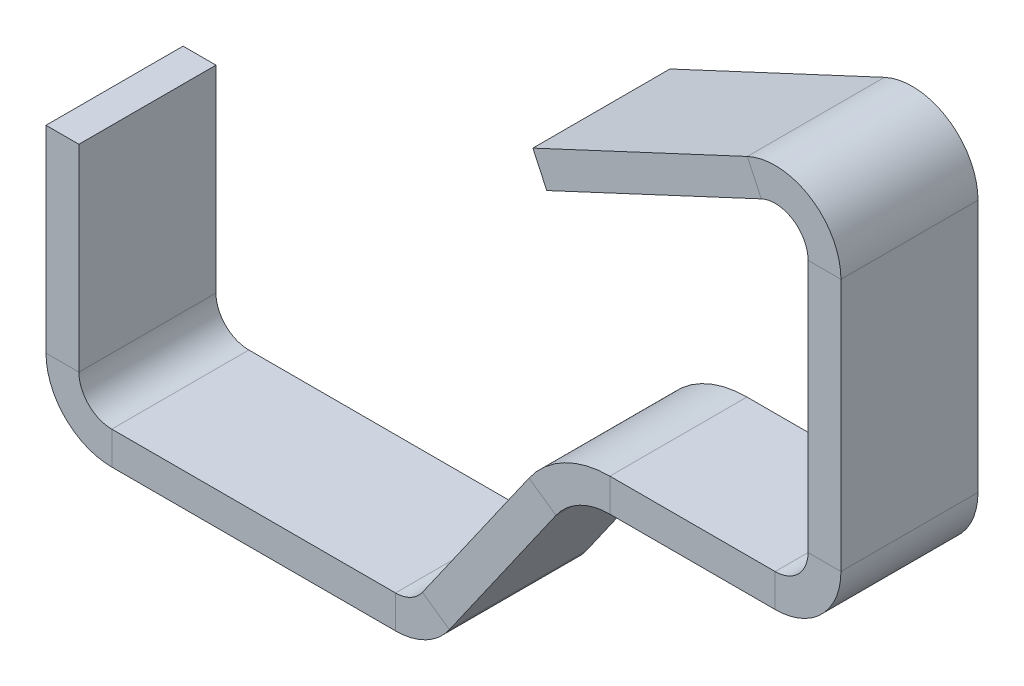
ISO-10303-21;
HEADER;
FILE_DESCRIPTION(('STEP AP214'),'2;1');
FILE_NAME('part.step','',(''),(''),'','','');
FILE_SCHEMA(('AUTOMOTIVE_DESIGN { 1 0 10303 214 1 1 1 1 }'));
ENDSEC;
DATA;
#1=APPLICATION_CONTEXT('core data for automotive mechanical design processes');
#2=APPLICATION_PROTOCOL_DEFINITION('international standard','automotive_design',2000,#1);
#3=PRODUCT_CONTEXT('',#1,'mechanical');
#4=PRODUCT('Part','Part','',(#3));
#5=PRODUCT_RELATED_PRODUCT_CATEGORY('part','',(#4));
#6=PRODUCT_DEFINITION_FORMATION('','',#4);
#7=PRODUCT_DEFINITION_CONTEXT('part definition',#1,'design');
#8=PRODUCT_DEFINITION('design','',#6,#7);
#9=PRODUCT_DEFINITION_SHAPE('','',#8);
#10=(LENGTH_UNIT() NAMED_UNIT(*) SI_UNIT(.MILLI.,.METRE.));
#11=(NAMED_UNIT(*) PLANE_ANGLE_UNIT() SI_UNIT($,.RADIAN.));
#12=(NAMED_UNIT(*) SI_UNIT($,.STERADIAN.) SOLID_ANGLE_UNIT());
#13=UNCERTAINTY_MEASURE_WITH_UNIT(LENGTH_MEASURE(1.E-05),#10,'distance_accuracy_value','');
#14=(GEOMETRIC_REPRESENTATION_CONTEXT(3) GLOBAL_UNCERTAINTY_ASSIGNED_CONTEXT((#13)) GLOBAL_UNIT_ASSIGNED_CONTEXT((#10,
#11,#12)) REPRESENTATION_CONTEXT('',''));
#15=CARTESIAN_POINT('',(0.,0.,0.));
#16=DIRECTION('',(0.,0.,1.));
#17=DIRECTION('',(1.,0.,0.));
#18=AXIS2_PLACEMENT_3D('',#15,#16,#17);
#19=CARTESIAN_POINT('',(0.,0.,0.));
#20=DIRECTION('',(0.,-1.,0.));
#21=DIRECTION('',(1.,0.,0.));
#22=AXIS2_PLACEMENT_3D('',#19,#20,#21);
#23=PLANE('',#22);
#24=DIRECTION('',(0.,0.,-1.));
#25=VECTOR('',#24,1.);
#26=CARTESIAN_POINT('',(0.,0.,-12.5));
#27=LINE('',#26,#25);
#28=CARTESIAN_POINT('',(0.,0.,12.5));
#29=VERTEX_POINT('',#28);
#30=CARTESIAN_POINT('',(0.,0.,-12.5));
#31=VERTEX_POINT('',#30);
#32=EDGE_CURVE('E245',#29,#31,#27,.T.);
#33=ORIENTED_EDGE('',*,*,#32,.F.);
#34=DIRECTION('',(-1.,0.,0.));
#35=VECTOR('',#34,1.);
#36=CARTESIAN_POINT('',(6.,0.,12.5));
#37=LINE('',#36,#35);
#38=CARTESIAN_POINT('',(6.,0.,12.5));
#39=VERTEX_POINT('',#38);
#40=EDGE_CURVE('E229',#39,#29,#37,.T.);
#41=ORIENTED_EDGE('',*,*,#40,.F.);
#42=DIRECTION('',(0.,0.,1.));
#43=VECTOR('',#42,1.);
#44=CARTESIAN_POINT('',(6.,0.,-12.5));
#45=LINE('',#44,#43);
#46=CARTESIAN_POINT('',(6.,0.,-12.5));
#47=VERTEX_POINT('',#46);
#48=EDGE_CURVE('E224',#47,#39,#45,.T.);
#49=ORIENTED_EDGE('',*,*,#48,.F.);
#50=DIRECTION('',(1.,0.,0.));
#51=VECTOR('',#50,1.);
#52=CARTESIAN_POINT('',(6.,0.,-12.5));
#53=LINE('',#52,#51);
#54=EDGE_CURVE('E226',#31,#47,#53,.T.);
#55=ORIENTED_EDGE('',*,*,#54,.F.);
#56=EDGE_LOOP('',(#33,#41,#49,#55));
#57=FACE_BOUND('',#56,.T.);
#58=ADVANCED_FACE('F43',(#57),#23,.F.);
#59=CARTESIAN_POINT('',(88.8089172037278,40.7976677720763,0.));
#60=DIRECTION('',(-0.906307787036648,-0.422618261740704,0.));
#61=DIRECTION('',(0.422618261740704,-0.906307787036648,0.));
#62=AXIS2_PLACEMENT_3D('',#59,#60,#61);
#63=PLANE('',#62);
#64=DIRECTION('',(0.,0.,-1.));
#65=VECTOR('',#64,1.);
#66=CARTESIAN_POINT('',(88.8089172037278,40.7976677720763,-12.5));
#67=LINE('',#66,#65);
#68=CARTESIAN_POINT('',(88.8089172037278,40.7976677720763,12.5));
#69=VERTEX_POINT('',#68);
#70=CARTESIAN_POINT('',(88.8089172037278,40.7976677720763,-12.5));
#71=VERTEX_POINT('',#70);
#72=EDGE_CURVE('E57',#69,#71,#67,.T.);
#73=ORIENTED_EDGE('',*,*,#72,.T.);
#74=DIRECTION('',(0.422618261740704,-0.906307787036648,0.));
#75=VECTOR('',#74,1.);
#76=CARTESIAN_POINT('',(91.344626774172,35.3598210498565,-12.5));
#77=LINE('',#76,#75);
#78=CARTESIAN_POINT('',(91.344626774172,35.3598210498565,-12.5));
#79=VERTEX_POINT('',#78);
#80=EDGE_CURVE('E11',#71,#79,#77,.T.);
#81=ORIENTED_EDGE('',*,*,#80,.T.);
#82=DIRECTION('',(0.,0.,1.));
#83=VECTOR('',#82,1.);
#84=CARTESIAN_POINT('',(91.344626774172,35.3598210498565,-12.5));
#85=LINE('',#84,#83);
#86=CARTESIAN_POINT('',(91.344626774172,35.3598210498565,12.5));
#87=VERTEX_POINT('',#86);
#88=EDGE_CURVE('E382',#79,#87,#85,.T.);
#89=ORIENTED_EDGE('',*,*,#88,.T.);
#90=DIRECTION('',(-0.422618261740704,0.906307787036648,0.));
#91=VECTOR('',#90,1.);
#92=CARTESIAN_POINT('',(91.344626774172,35.3598210498565,12.5));
#93=LINE('',#92,#91);
#94=EDGE_CURVE('E63',#87,#69,#93,.T.);
#95=ORIENTED_EDGE('',*,*,#94,.T.);
#96=EDGE_LOOP('',(#73,#81,#89,#95));
#97=FACE_BOUND('',#96,.T.);
#98=ADVANCED_FACE('F664',(#97),#63,.T.);
#99=CARTESIAN_POINT('',(6.,0.,-12.5));
#100=DIRECTION('',(1.,0.,0.));
#101=DIRECTION('',(0.,1.,0.));
#102=AXIS2_PLACEMENT_3D('',#99,#100,#101);
#103=PLANE('',#102);
#104=DIRECTION('',(0.,-1.,0.));
#105=VECTOR('',#104,1.);
#106=CARTESIAN_POINT('',(6.,0.,12.5));
#107=LINE('',#106,#105);
#108=CARTESIAN_POINT('',(6.00000000000001,-35.9999999999999,12.5));
#109=VERTEX_POINT('',#108);
#110=EDGE_CURVE('E254',#39,#109,#107,.T.);
#111=ORIENTED_EDGE('',*,*,#110,.T.);
#112=DIRECTION('',(0.,0.,1.));
#113=VECTOR('',#112,1.);
#114=CARTESIAN_POINT('',(6.00000000000001,-35.9999999999999,-12.5));
#115=LINE('',#114,#113);
#116=CARTESIAN_POINT('',(6.00000000000001,-35.9999999999999,-12.5));
#117=VERTEX_POINT('',#116);
#118=EDGE_CURVE('E250',#117,#109,#115,.T.);
#119=ORIENTED_EDGE('',*,*,#118,.F.);
#120=DIRECTION('',(0.,-1.,0.));
#121=VECTOR('',#120,1.);
#122=CARTESIAN_POINT('',(6.,0.,-12.5));
#123=LINE('',#122,#121);
#124=EDGE_CURVE('E241',#47,#117,#123,.T.);
#125=ORIENTED_EDGE('',*,*,#124,.F.);
#126=ORIENTED_EDGE('',*,*,#48,.T.);
#127=EDGE_LOOP('',(#111,#119,#125,#126));
#128=FACE_BOUND('',#127,.T.);
#129=ADVANCED_FACE('F248',(#128),#103,.T.);
#130=CARTESIAN_POINT('',(6.,0.,12.5));
#131=DIRECTION('',(0.,0.,1.));
#132=DIRECTION('',(1.,0.,0.));
#133=AXIS2_PLACEMENT_3D('',#130,#131,#132);
#134=PLANE('',#133);
#135=DIRECTION('',(0.,-1.,0.));
#136=VECTOR('',#135,1.);
#137=CARTESIAN_POINT('',(0.,0.,12.5));
#138=LINE('',#137,#136);
#139=CARTESIAN_POINT('',(0.,-35.9999999999999,12.5));
#140=VERTEX_POINT('',#139);
#141=EDGE_CURVE('E398',#29,#140,#138,.T.);
#142=ORIENTED_EDGE('',*,*,#141,.T.);
#143=DIRECTION('',(-1.,0.,0.));
#144=VECTOR('',#143,1.);
#145=CARTESIAN_POINT('',(6.00000000000001,-35.9999999999999,12.5));
#146=LINE('',#145,#144);
#147=EDGE_CURVE('E394',#109,#140,#146,.T.);
#148=ORIENTED_EDGE('',*,*,#147,.F.);
#149=ORIENTED_EDGE('',*,*,#110,.F.);
#150=ORIENTED_EDGE('',*,*,#40,.T.);
#151=EDGE_LOOP('',(#142,#148,#149,#150));
#152=FACE_BOUND('',#151,.T.);
#153=ADVANCED_FACE('F710',(#152),#134,.T.);
#154=CARTESIAN_POINT('',(0.,0.,-12.5));
#155=DIRECTION('',(-1.,0.,0.));
#156=DIRECTION('',(0.,-1.,0.));
#157=AXIS2_PLACEMENT_3D('',#154,#155,#156);
#158=PLANE('',#157);
#159=DIRECTION('',(0.,-1.,0.));
#160=VECTOR('',#159,1.);
#161=CARTESIAN_POINT('',(0.,0.,-12.5));
#162=LINE('',#161,#160);
#163=CARTESIAN_POINT('',(0.,-35.9999999999999,-12.5));
#164=VERTEX_POINT('',#163);
#165=EDGE_CURVE('E243',#31,#164,#162,.T.);
#166=ORIENTED_EDGE('',*,*,#165,.T.);
#167=DIRECTION('',(0.,0.,-1.));
#168=VECTOR('',#167,1.);
#169=CARTESIAN_POINT('',(0.,-35.9999999999999,-12.5));
#170=LINE('',#169,#168);
#171=EDGE_CURVE('E402',#140,#164,#170,.T.);
#172=ORIENTED_EDGE('',*,*,#171,.F.);
#173=ORIENTED_EDGE('',*,*,#141,.F.);
#174=ORIENTED_EDGE('',*,*,#32,.T.);
#175=EDGE_LOOP('',(#166,#172,#173,#174));
#176=FACE_BOUND('',#175,.T.);
#177=ADVANCED_FACE('F631',(#176),#158,.T.);
#178=CARTESIAN_POINT('',(6.,0.,-12.5));
#179=DIRECTION('',(0.,0.,-1.));
#180=DIRECTION('',(-1.,0.,0.));
#181=AXIS2_PLACEMENT_3D('',#178,#179,#180);
#182=PLANE('',#181);
#183=DIRECTION('',(1.,0.,0.));
#184=VECTOR('',#183,1.);
#185=CARTESIAN_POINT('',(6.00000000000001,-35.9999999999999,-12.5));
#186=LINE('',#185,#184);
#187=EDGE_CURVE('E271',#164,#117,#186,.T.);
#188=ORIENTED_EDGE('',*,*,#187,.F.);
#189=ORIENTED_EDGE('',*,*,#165,.F.);
#190=ORIENTED_EDGE('',*,*,#54,.T.);
#191=ORIENTED_EDGE('',*,*,#124,.T.);
#192=EDGE_LOOP('',(#188,#189,#190,#191));
#193=FACE_BOUND('',#192,.T.);
#194=ADVANCED_FACE('F240',(#193),#182,.T.);
#195=CARTESIAN_POINT('',(12.,-36.,0.));
#196=DIRECTION('',(0.,0.,1.));
#197=DIRECTION('',(1.,0.,0.));
#198=AXIS2_PLACEMENT_3D('',#195,#196,#197);
#199=CYLINDRICAL_SURFACE('',#198,6.00000000000001);
#200=CARTESIAN_POINT('',(12.,-36.,12.5));
#201=DIRECTION('',(0.,0.,1.));
#202=DIRECTION('',(-1.,0.,0.));
#203=AXIS2_PLACEMENT_3D('',#200,#201,#202);
#204=CIRCLE('',#203,6.00000000000001);
#205=CARTESIAN_POINT('',(12.0000000000001,-42.,12.5));
#206=VERTEX_POINT('',#205);
#207=EDGE_CURVE('E262',#109,#206,#204,.T.);
#208=ORIENTED_EDGE('',*,*,#207,.T.);
#209=DIRECTION('',(0.,0.,1.));
#210=VECTOR('',#209,1.);
#211=CARTESIAN_POINT('',(12.0000000000001,-42.,-12.5));
#212=LINE('',#211,#210);
#213=CARTESIAN_POINT('',(12.0000000000001,-42.,-12.5));
#214=VERTEX_POINT('',#213);
#215=EDGE_CURVE('E258',#214,#206,#212,.T.);
#216=ORIENTED_EDGE('',*,*,#215,.F.);
#217=CARTESIAN_POINT('',(12.,-36.,-12.5));
#218=DIRECTION('',(0.,0.,1.));
#219=DIRECTION('',(-1.,0.,0.));
#220=AXIS2_PLACEMENT_3D('',#217,#218,#219);
#221=CIRCLE('',#220,6.00000000000001);
#222=EDGE_CURVE('E263',#117,#214,#221,.T.);
#223=ORIENTED_EDGE('',*,*,#222,.F.);
#224=ORIENTED_EDGE('',*,*,#118,.T.);
#225=EDGE_LOOP('',(#208,#216,#223,#224));
#226=FACE_BOUND('',#225,.T.);
#227=ADVANCED_FACE('F627',(#226),#199,.F.);
#228=CARTESIAN_POINT('',(6.00000000000001,-35.9999999999999,12.5));
#229=DIRECTION('',(0.,0.,1.));
#230=DIRECTION('',(1.,0.,0.));
#231=AXIS2_PLACEMENT_3D('',#228,#229,#230);
#232=PLANE('',#231);
#233=CARTESIAN_POINT('',(12.,-36.,12.5));
#234=DIRECTION('',(0.,0.,1.));
#235=DIRECTION('',(-1.,0.,0.));
#236=AXIS2_PLACEMENT_3D('',#233,#234,#235);
#237=CIRCLE('',#236,12.);
#238=CARTESIAN_POINT('',(12.0000000000001,-48.,12.5));
#239=VERTEX_POINT('',#238);
#240=EDGE_CURVE('E406',#140,#239,#237,.T.);
#241=ORIENTED_EDGE('',*,*,#240,.T.);
#242=DIRECTION('',(0.,-1.,0.));
#243=VECTOR('',#242,1.);
#244=CARTESIAN_POINT('',(12.0000000000001,-42.,12.5));
#245=LINE('',#244,#243);
#246=EDGE_CURVE('E267',#206,#239,#245,.T.);
#247=ORIENTED_EDGE('',*,*,#246,.F.);
#248=ORIENTED_EDGE('',*,*,#207,.F.);
#249=ORIENTED_EDGE('',*,*,#147,.T.);
#250=EDGE_LOOP('',(#241,#247,#248,#249));
#251=FACE_BOUND('',#250,.T.);
#252=ADVANCED_FACE('F638',(#251),#232,.T.);
#253=CARTESIAN_POINT('',(12.,-36.,0.));
#254=DIRECTION('',(0.,0.,1.));
#255=DIRECTION('',(1.,0.,0.));
#256=AXIS2_PLACEMENT_3D('',#253,#254,#255);
#257=CYLINDRICAL_SURFACE('',#256,12.);
#258=CARTESIAN_POINT('',(12.,-36.,-12.5));
#259=DIRECTION('',(0.,0.,1.));
#260=DIRECTION('',(-1.,0.,0.));
#261=AXIS2_PLACEMENT_3D('',#258,#259,#260);
#262=CIRCLE('',#261,12.);
#263=CARTESIAN_POINT('',(12.0000000000001,-48.,-12.5));
#264=VERTEX_POINT('',#263);
#265=EDGE_CURVE('E485',#164,#264,#262,.T.);
#266=ORIENTED_EDGE('',*,*,#265,.T.);
#267=DIRECTION('',(0.,0.,-1.));
#268=VECTOR('',#267,1.);
#269=CARTESIAN_POINT('',(12.0000000000001,-48.,-12.5));
#270=LINE('',#269,#268);
#271=EDGE_CURVE('E410',#239,#264,#270,.T.);
#272=ORIENTED_EDGE('',*,*,#271,.F.);
#273=ORIENTED_EDGE('',*,*,#240,.F.);
#274=ORIENTED_EDGE('',*,*,#171,.T.);
#275=EDGE_LOOP('',(#266,#272,#273,#274));
#276=FACE_BOUND('',#275,.T.);
#277=ADVANCED_FACE('F634',(#276),#257,.T.);
#278=CARTESIAN_POINT('',(6.00000000000001,-35.9999999999999,-12.5));
#279=DIRECTION('',(0.,0.,-1.));
#280=DIRECTION('',(-1.,0.,0.));
#281=AXIS2_PLACEMENT_3D('',#278,#279,#280);
#282=PLANE('',#281);
#283=DIRECTION('',(0.,1.,0.));
#284=VECTOR('',#283,1.);
#285=CARTESIAN_POINT('',(12.0000000000001,-42.,-12.5));
#286=LINE('',#285,#284);
#287=EDGE_CURVE('E285',#264,#214,#286,.T.);
#288=ORIENTED_EDGE('',*,*,#287,.F.);
#289=ORIENTED_EDGE('',*,*,#265,.F.);
#290=ORIENTED_EDGE('',*,*,#187,.T.);
#291=ORIENTED_EDGE('',*,*,#222,.T.);
#292=EDGE_LOOP('',(#288,#289,#290,#291));
#293=FACE_BOUND('',#292,.T.);
#294=ADVANCED_FACE('F628',(#293),#282,.T.);
#295=CARTESIAN_POINT('',(12.0000000000001,-42.,-12.5));
#296=DIRECTION('',(0.,1.,0.));
#297=DIRECTION('',(-1.,0.,0.));
#298=AXIS2_PLACEMENT_3D('',#295,#296,#297);
#299=PLANE('',#298);
#300=DIRECTION('',(1.,0.,0.));
#301=VECTOR('',#300,1.);
#302=CARTESIAN_POINT('',(12.0000000000001,-42.,12.5));
#303=LINE('',#302,#301);
#304=CARTESIAN_POINT('',(63.753195393379,-42.,12.5));
#305=VERTEX_POINT('',#304);
#306=EDGE_CURVE('E276',#206,#305,#303,.T.);
#307=ORIENTED_EDGE('',*,*,#306,.T.);
#308=DIRECTION('',(0.,0.,1.));
#309=VECTOR('',#308,1.);
#310=CARTESIAN_POINT('',(63.753195393379,-42.,-12.5));
#311=LINE('',#310,#309);
#312=CARTESIAN_POINT('',(63.753195393379,-42.,-12.5));
#313=VERTEX_POINT('',#312);
#314=EDGE_CURVE('E272',#313,#305,#311,.T.);
#315=ORIENTED_EDGE('',*,*,#314,.F.);
#316=DIRECTION('',(1.,0.,0.));
#317=VECTOR('',#316,1.);
#318=CARTESIAN_POINT('',(12.0000000000001,-42.,-12.5));
#319=LINE('',#318,#317);
#320=EDGE_CURVE('E277',#214,#313,#319,.T.);
#321=ORIENTED_EDGE('',*,*,#320,.F.);
#322=ORIENTED_EDGE('',*,*,#215,.T.);
#323=EDGE_LOOP('',(#307,#315,#321,#322));
#324=FACE_BOUND('',#323,.T.);
#325=ADVANCED_FACE('F621',(#324),#299,.T.);
#326=CARTESIAN_POINT('',(12.0000000000001,-42.,12.5));
#327=DIRECTION('',(0.,0.,1.));
#328=DIRECTION('',(1.,0.,0.));
#329=AXIS2_PLACEMENT_3D('',#326,#327,#328);
#330=PLANE('',#329);
#331=DIRECTION('',(1.,0.,0.));
#332=VECTOR('',#331,1.);
#333=CARTESIAN_POINT('',(12.0000000000001,-48.,12.5));
#334=LINE('',#333,#332);
#335=CARTESIAN_POINT('',(63.753195393379,-48.,12.5));
#336=VERTEX_POINT('',#335);
#337=EDGE_CURVE('E414',#239,#336,#334,.T.);
#338=ORIENTED_EDGE('',*,*,#337,.T.);
#339=DIRECTION('',(0.,-1.,0.));
#340=VECTOR('',#339,1.);
#341=CARTESIAN_POINT('',(63.753195393379,-42.,12.5));
#342=LINE('',#341,#340);
#343=EDGE_CURVE('E281',#305,#336,#342,.T.);
#344=ORIENTED_EDGE('',*,*,#343,.F.);
#345=ORIENTED_EDGE('',*,*,#306,.F.);
#346=ORIENTED_EDGE('',*,*,#246,.T.);
#347=EDGE_LOOP('',(#338,#344,#345,#346));
#348=FACE_BOUND('',#347,.T.);
#349=ADVANCED_FACE('F641',(#348),#330,.T.);
#350=CARTESIAN_POINT('',(12.0000000000001,-48.,-12.5));
#351=DIRECTION('',(0.,-1.,0.));
#352=DIRECTION('',(1.,0.,0.));
#353=AXIS2_PLACEMENT_3D('',#350,#351,#352);
#354=PLANE('',#353);
#355=DIRECTION('',(1.,0.,0.));
#356=VECTOR('',#355,1.);
#357=CARTESIAN_POINT('',(12.0000000000001,-48.,-12.5));
#358=LINE('',#357,#356);
#359=CARTESIAN_POINT('',(63.753195393379,-48.,-12.5));
#360=VERTEX_POINT('',#359);
#361=EDGE_CURVE('E492',#264,#360,#358,.T.);
#362=ORIENTED_EDGE('',*,*,#361,.T.);
#363=DIRECTION('',(0.,0.,-1.));
#364=VECTOR('',#363,1.);
#365=CARTESIAN_POINT('',(63.753195393379,-48.,-12.5));
#366=LINE('',#365,#364);
#367=EDGE_CURVE('E418',#336,#360,#366,.T.);
#368=ORIENTED_EDGE('',*,*,#367,.F.);
#369=ORIENTED_EDGE('',*,*,#337,.F.);
#370=ORIENTED_EDGE('',*,*,#271,.T.);
#371=EDGE_LOOP('',(#362,#368,#369,#370));
#372=FACE_BOUND('',#371,.T.);
#373=ADVANCED_FACE('F686',(#372),#354,.T.);
#374=CARTESIAN_POINT('',(12.0000000000001,-42.,-12.5));
#375=DIRECTION('',(0.,0.,-1.));
#376=DIRECTION('',(-1.,0.,0.));
#377=AXIS2_PLACEMENT_3D('',#374,#375,#376);
#378=PLANE('',#377);
#379=DIRECTION('',(0.,1.,0.));
#380=VECTOR('',#379,1.);
#381=CARTESIAN_POINT('',(63.753195393379,-42.,-12.5));
#382=LINE('',#381,#380);
#383=EDGE_CURVE('E299',#360,#313,#382,.T.);
#384=ORIENTED_EDGE('',*,*,#383,.F.);
#385=ORIENTED_EDGE('',*,*,#361,.F.);
#386=ORIENTED_EDGE('',*,*,#287,.T.);
#387=ORIENTED_EDGE('',*,*,#320,.T.);
#388=EDGE_LOOP('',(#384,#385,#386,#387));
#389=FACE_BOUND('',#388,.T.);
#390=ADVANCED_FACE('F622',(#389),#378,.T.);
#391=CARTESIAN_POINT('',(63.7531953933791,-36.,0.));
#392=DIRECTION('',(0.,0.,1.));
#393=DIRECTION('',(1.,0.,0.));
#394=AXIS2_PLACEMENT_3D('',#391,#392,#393);
#395=CYLINDRICAL_SURFACE('',#394,6.);
#396=CARTESIAN_POINT('',(63.7531953933791,-36.,12.5));
#397=DIRECTION('',(0.,0.,1.));
#398=DIRECTION('',(0.,-1.,0.));
#399=AXIS2_PLACEMENT_3D('',#396,#397,#398);
#400=CIRCLE('',#399,6.);
#401=CARTESIAN_POINT('',(68.668107659113,-39.4414586181062,12.5));
#402=VERTEX_POINT('',#401);
#403=EDGE_CURVE('E290',#305,#402,#400,.T.);
#404=ORIENTED_EDGE('',*,*,#403,.T.);
#405=DIRECTION('',(0.,0.,1.));
#406=VECTOR('',#405,1.);
#407=CARTESIAN_POINT('',(68.668107659113,-39.4414586181062,-12.5));
#408=LINE('',#407,#406);
#409=CARTESIAN_POINT('',(68.668107659113,-39.4414586181062,-12.5));
#410=VERTEX_POINT('',#409);
#411=EDGE_CURVE('E286',#410,#402,#408,.T.);
#412=ORIENTED_EDGE('',*,*,#411,.F.);
#413=CARTESIAN_POINT('',(63.7531953933791,-36.,-12.5));
#414=DIRECTION('',(0.,0.,1.));
#415=DIRECTION('',(0.,-1.,0.));
#416=AXIS2_PLACEMENT_3D('',#413,#414,#415);
#417=CIRCLE('',#416,6.);
#418=EDGE_CURVE('E291',#313,#410,#417,.T.);
#419=ORIENTED_EDGE('',*,*,#418,.F.);
#420=ORIENTED_EDGE('',*,*,#314,.T.);
#421=EDGE_LOOP('',(#404,#412,#419,#420));
#422=FACE_BOUND('',#421,.T.);
#423=ADVANCED_FACE('F615',(#422),#395,.F.);
#424=CARTESIAN_POINT('',(63.753195393379,-42.,12.5));
#425=DIRECTION('',(0.,0.,1.));
#426=DIRECTION('',(1.,0.,0.));
#427=AXIS2_PLACEMENT_3D('',#424,#425,#426);
#428=PLANE('',#427);
#429=CARTESIAN_POINT('',(63.7531953933791,-36.,12.5));
#430=DIRECTION('',(0.,0.,1.));
#431=DIRECTION('',(0.,-1.,0.));
#432=AXIS2_PLACEMENT_3D('',#429,#430,#431);
#433=CIRCLE('',#432,12.);
#434=CARTESIAN_POINT('',(73.583019924847,-42.8829172362125,12.5));
#435=VERTEX_POINT('',#434);
#436=EDGE_CURVE('E422',#336,#435,#433,.T.);
#437=ORIENTED_EDGE('',*,*,#436,.T.);
#438=DIRECTION('',(0.819152044288996,-0.573576436351041,0.));
#439=VECTOR('',#438,1.);
#440=CARTESIAN_POINT('',(68.668107659113,-39.4414586181062,12.5));
#441=LINE('',#440,#439);
#442=EDGE_CURVE('E295',#402,#435,#441,.T.);
#443=ORIENTED_EDGE('',*,*,#442,.F.);
#444=ORIENTED_EDGE('',*,*,#403,.F.);
#445=ORIENTED_EDGE('',*,*,#343,.T.);
#446=EDGE_LOOP('',(#437,#443,#444,#445));
#447=FACE_BOUND('',#446,.T.);
#448=ADVANCED_FACE('F644',(#447),#428,.T.);
#449=CARTESIAN_POINT('',(63.7531953933791,-36.,0.));
#450=DIRECTION('',(0.,0.,1.));
#451=DIRECTION('',(1.,0.,0.));
#452=AXIS2_PLACEMENT_3D('',#449,#450,#451);
#453=CYLINDRICAL_SURFACE('',#452,12.);
#454=CARTESIAN_POINT('',(63.7531953933791,-36.,-12.5));
#455=DIRECTION('',(0.,0.,1.));
#456=DIRECTION('',(0.,-1.,0.));
#457=AXIS2_PLACEMENT_3D('',#454,#455,#456);
#458=CIRCLE('',#457,12.);
#459=CARTESIAN_POINT('',(73.583019924847,-42.8829172362125,-12.5));
#460=VERTEX_POINT('',#459);
#461=EDGE_CURVE('E499',#360,#460,#458,.T.);
#462=ORIENTED_EDGE('',*,*,#461,.T.);
#463=DIRECTION('',(0.,0.,-1.));
#464=VECTOR('',#463,1.);
#465=CARTESIAN_POINT('',(73.583019924847,-42.8829172362125,-12.5));
#466=LINE('',#465,#464);
#467=EDGE_CURVE('E426',#435,#460,#466,.T.);
#468=ORIENTED_EDGE('',*,*,#467,.F.);
#469=ORIENTED_EDGE('',*,*,#436,.F.);
#470=ORIENTED_EDGE('',*,*,#367,.T.);
#471=EDGE_LOOP('',(#462,#468,#469,#470));
#472=FACE_BOUND('',#471,.T.);
#473=ADVANCED_FACE('F683',(#472),#453,.T.);
#474=CARTESIAN_POINT('',(63.753195393379,-42.,-12.5));
#475=DIRECTION('',(0.,0.,-1.));
#476=DIRECTION('',(-1.,0.,0.));
#477=AXIS2_PLACEMENT_3D('',#474,#475,#476);
#478=PLANE('',#477);
#479=DIRECTION('',(-0.819152044288996,0.573576436351041,0.));
#480=VECTOR('',#479,1.);
#481=CARTESIAN_POINT('',(68.668107659113,-39.4414586181062,-12.5));
#482=LINE('',#481,#480);
#483=EDGE_CURVE('E313',#460,#410,#482,.T.);
#484=ORIENTED_EDGE('',*,*,#483,.F.);
#485=ORIENTED_EDGE('',*,*,#461,.F.);
#486=ORIENTED_EDGE('',*,*,#383,.T.);
#487=ORIENTED_EDGE('',*,*,#418,.T.);
#488=EDGE_LOOP('',(#484,#485,#486,#487));
#489=FACE_BOUND('',#488,.T.);
#490=ADVANCED_FACE('F616',(#489),#478,.T.);
#491=CARTESIAN_POINT('',(68.668107659113,-39.4414586181062,-12.5));
#492=DIRECTION('',(-0.819152044288993,0.573576436351044,0.));
#493=DIRECTION('',(-0.573576436351044,-0.819152044288994,0.));
#494=AXIS2_PLACEMENT_3D('',#491,#492,#493);
#495=PLANE('',#494);
#496=DIRECTION('',(0.573576436351044,0.819152044288993,0.));
#497=VECTOR('',#496,1.);
#498=CARTESIAN_POINT('',(68.668107659113,-39.4414586181062,12.5));
#499=LINE('',#498,#497);
#500=CARTESIAN_POINT('',(88.1099542613879,-11.6756241456813,12.5));
#501=VERTEX_POINT('',#500);
#502=EDGE_CURVE('E304',#402,#501,#499,.T.);
#503=ORIENTED_EDGE('',*,*,#502,.T.);
#504=DIRECTION('',(0.,0.,1.));
#505=VECTOR('',#504,1.);
#506=CARTESIAN_POINT('',(88.1099542613879,-11.6756241456813,-12.5));
#507=LINE('',#506,#505);
#508=CARTESIAN_POINT('',(88.1099542613879,-11.6756241456813,-12.5));
#509=VERTEX_POINT('',#508);
#510=EDGE_CURVE('E300',#509,#501,#507,.T.);
#511=ORIENTED_EDGE('',*,*,#510,.F.);
#512=DIRECTION('',(0.573576436351044,0.819152044288993,0.));
#513=VECTOR('',#512,1.);
#514=CARTESIAN_POINT('',(68.668107659113,-39.4414586181062,-12.5));
#515=LINE('',#514,#513);
#516=EDGE_CURVE('E305',#410,#509,#515,.T.);
#517=ORIENTED_EDGE('',*,*,#516,.F.);
#518=ORIENTED_EDGE('',*,*,#411,.T.);
#519=EDGE_LOOP('',(#503,#511,#517,#518));
#520=FACE_BOUND('',#519,.T.);
#521=ADVANCED_FACE('F609',(#520),#495,.T.);
#522=CARTESIAN_POINT('',(68.668107659113,-39.4414586181062,12.5));
#523=DIRECTION('',(0.,0.,1.));
#524=DIRECTION('',(1.,0.,0.));
#525=AXIS2_PLACEMENT_3D('',#522,#523,#524);
#526=PLANE('',#525);
#527=DIRECTION('',(0.573576436351044,0.819152044288993,0.));
#528=VECTOR('',#527,1.);
#529=CARTESIAN_POINT('',(73.583019924847,-42.8829172362125,12.5));
#530=LINE('',#529,#528);
#531=CARTESIAN_POINT('',(93.0248665271219,-15.1170827637875,12.5));
#532=VERTEX_POINT('',#531);
#533=EDGE_CURVE('E430',#435,#532,#530,.T.);
#534=ORIENTED_EDGE('',*,*,#533,.T.);
#535=DIRECTION('',(0.819152044288993,-0.573576436351044,0.));
#536=VECTOR('',#535,1.);
#537=CARTESIAN_POINT('',(88.1099542613879,-11.6756241456813,12.5));
#538=LINE('',#537,#536);
#539=EDGE_CURVE('E309',#501,#532,#538,.T.);
#540=ORIENTED_EDGE('',*,*,#539,.F.);
#541=ORIENTED_EDGE('',*,*,#502,.F.);
#542=ORIENTED_EDGE('',*,*,#442,.T.);
#543=EDGE_LOOP('',(#534,#540,#541,#542));
#544=FACE_BOUND('',#543,.T.);
#545=ADVANCED_FACE('F647',(#544),#526,.T.);
#546=CARTESIAN_POINT('',(73.583019924847,-42.8829172362125,-12.5));
#547=DIRECTION('',(0.819152044288993,-0.573576436351044,0.));
#548=DIRECTION('',(0.573576436351044,0.819152044288994,0.));
#549=AXIS2_PLACEMENT_3D('',#546,#547,#548);
#550=PLANE('',#549);
#551=DIRECTION('',(0.573576436351044,0.819152044288993,0.));
#552=VECTOR('',#551,1.);
#553=CARTESIAN_POINT('',(73.583019924847,-42.8829172362125,-12.5));
#554=LINE('',#553,#552);
#555=CARTESIAN_POINT('',(93.0248665271219,-15.1170827637875,-12.5));
#556=VERTEX_POINT('',#555);
#557=EDGE_CURVE('E506',#460,#556,#554,.T.);
#558=ORIENTED_EDGE('',*,*,#557,.T.);
#559=DIRECTION('',(0.,0.,-1.));
#560=VECTOR('',#559,1.);
#561=CARTESIAN_POINT('',(93.0248665271219,-15.1170827637875,-12.5));
#562=LINE('',#561,#560);
#563=EDGE_CURVE('E434',#532,#556,#562,.T.);
#564=ORIENTED_EDGE('',*,*,#563,.F.);
#565=ORIENTED_EDGE('',*,*,#533,.F.);
#566=ORIENTED_EDGE('',*,*,#467,.T.);
#567=EDGE_LOOP('',(#558,#564,#565,#566));
#568=FACE_BOUND('',#567,.T.);
#569=ADVANCED_FACE('F680',(#568),#550,.T.);
#570=CARTESIAN_POINT('',(68.668107659113,-39.4414586181062,-12.5));
#571=DIRECTION('',(0.,0.,-1.));
#572=DIRECTION('',(-1.,0.,0.));
#573=AXIS2_PLACEMENT_3D('',#570,#571,#572);
#574=PLANE('',#573);
#575=DIRECTION('',(-0.819152044288993,0.573576436351044,0.));
#576=VECTOR('',#575,1.);
#577=CARTESIAN_POINT('',(88.1099542613879,-11.6756241456813,-12.5));
#578=LINE('',#577,#576);
#579=EDGE_CURVE('E327',#556,#509,#578,.T.);
#580=ORIENTED_EDGE('',*,*,#579,.F.);
#581=ORIENTED_EDGE('',*,*,#557,.F.);
#582=ORIENTED_EDGE('',*,*,#483,.T.);
#583=ORIENTED_EDGE('',*,*,#516,.T.);
#584=EDGE_LOOP('',(#580,#581,#582,#583));
#585=FACE_BOUND('',#584,.T.);
#586=ADVANCED_FACE('F610',(#585),#574,.T.);
#587=CARTESIAN_POINT('',(102.85469105859,-22.,0.));
#588=DIRECTION('',(0.,0.,-1.));
#589=DIRECTION('',(-1.,0.,0.));
#590=AXIS2_PLACEMENT_3D('',#587,#588,#589);
#591=CYLINDRICAL_SURFACE('',#590,18.);
#592=CARTESIAN_POINT('',(102.85469105859,-22.,12.5));
#593=DIRECTION('',(0.,0.,-1.));
#594=DIRECTION('',(-0.819152044288996,0.573576436351041,0.));
#595=AXIS2_PLACEMENT_3D('',#592,#593,#594);
#596=CIRCLE('',#595,18.);
#597=CARTESIAN_POINT('',(102.85469105859,-4.00000000000002,12.5));
#598=VERTEX_POINT('',#597);
#599=EDGE_CURVE('E318',#501,#598,#596,.T.);
#600=ORIENTED_EDGE('',*,*,#599,.T.);
#601=DIRECTION('',(0.,0.,1.));
#602=VECTOR('',#601,1.);
#603=CARTESIAN_POINT('',(102.85469105859,-4.00000000000001,-12.5));
#604=LINE('',#603,#602);
#605=CARTESIAN_POINT('',(102.85469105859,-4.00000000000002,-12.5));
#606=VERTEX_POINT('',#605);
#607=EDGE_CURVE('E314',#606,#598,#604,.T.);
#608=ORIENTED_EDGE('',*,*,#607,.F.);
#609=CARTESIAN_POINT('',(102.85469105859,-22.,-12.5));
#610=DIRECTION('',(0.,0.,-1.));
#611=DIRECTION('',(-0.819152044288996,0.573576436351041,0.));
#612=AXIS2_PLACEMENT_3D('',#609,#610,#611);
#613=CIRCLE('',#612,18.);
#614=EDGE_CURVE('E319',#509,#606,#613,.T.);
#615=ORIENTED_EDGE('',*,*,#614,.F.);
#616=ORIENTED_EDGE('',*,*,#510,.T.);
#617=EDGE_LOOP('',(#600,#608,#615,#616));
#618=FACE_BOUND('',#617,.T.);
#619=ADVANCED_FACE('F603',(#618),#591,.T.);
#620=CARTESIAN_POINT('',(88.1099542613879,-11.6756241456813,12.5));
#621=DIRECTION('',(0.,0.,1.));
#622=DIRECTION('',(1.,0.,0.));
#623=AXIS2_PLACEMENT_3D('',#620,#621,#622);
#624=PLANE('',#623);
#625=CARTESIAN_POINT('',(102.85469105859,-22.,12.5));
#626=DIRECTION('',(0.,0.,-1.));
#627=DIRECTION('',(-0.819152044288996,0.573576436351041,0.));
#628=AXIS2_PLACEMENT_3D('',#625,#626,#627);
#629=CIRCLE('',#628,12.);
#630=CARTESIAN_POINT('',(102.85469105859,-10.,12.5));
#631=VERTEX_POINT('',#630);
#632=EDGE_CURVE('E438',#532,#631,#629,.T.);
#633=ORIENTED_EDGE('',*,*,#632,.T.);
#634=DIRECTION('',(0.,-1.,0.));
#635=VECTOR('',#634,1.);
#636=CARTESIAN_POINT('',(102.85469105859,-4.00000000000001,12.5));
#637=LINE('',#636,#635);
#638=EDGE_CURVE('E323',#598,#631,#637,.T.);
#639=ORIENTED_EDGE('',*,*,#638,.F.);
#640=ORIENTED_EDGE('',*,*,#599,.F.);
#641=ORIENTED_EDGE('',*,*,#539,.T.);
#642=EDGE_LOOP('',(#633,#639,#640,#641));
#643=FACE_BOUND('',#642,.T.);
#644=ADVANCED_FACE('F650',(#643),#624,.T.);
#645=CARTESIAN_POINT('',(102.85469105859,-22.,0.));
#646=DIRECTION('',(0.,0.,-1.));
#647=DIRECTION('',(-1.,0.,0.));
#648=AXIS2_PLACEMENT_3D('',#645,#646,#647);
#649=CYLINDRICAL_SURFACE('',#648,12.);
#650=CARTESIAN_POINT('',(102.85469105859,-22.,-12.5));
#651=DIRECTION('',(0.,0.,-1.));
#652=DIRECTION('',(-0.819152044288996,0.573576436351041,0.));
#653=AXIS2_PLACEMENT_3D('',#650,#651,#652);
#654=CIRCLE('',#653,12.);
#655=CARTESIAN_POINT('',(102.85469105859,-10.,-12.5));
#656=VERTEX_POINT('',#655);
#657=EDGE_CURVE('E513',#556,#656,#654,.T.);
#658=ORIENTED_EDGE('',*,*,#657,.T.);
#659=DIRECTION('',(0.,0.,-1.));
#660=VECTOR('',#659,1.);
#661=CARTESIAN_POINT('',(102.85469105859,-10.,-12.5));
#662=LINE('',#661,#660);
#663=EDGE_CURVE('E442',#631,#656,#662,.T.);
#664=ORIENTED_EDGE('',*,*,#663,.F.);
#665=ORIENTED_EDGE('',*,*,#632,.F.);
#666=ORIENTED_EDGE('',*,*,#563,.T.);
#667=EDGE_LOOP('',(#658,#664,#665,#666));
#668=FACE_BOUND('',#667,.T.);
#669=ADVANCED_FACE('F677',(#668),#649,.F.);
#670=CARTESIAN_POINT('',(88.1099542613879,-11.6756241456813,-12.5));
#671=DIRECTION('',(0.,0.,-1.));
#672=DIRECTION('',(-1.,0.,0.));
#673=AXIS2_PLACEMENT_3D('',#670,#671,#672);
#674=PLANE('',#673);
#675=DIRECTION('',(0.,1.,0.));
#676=VECTOR('',#675,1.);
#677=CARTESIAN_POINT('',(102.85469105859,-4.00000000000001,-12.5));
#678=LINE('',#677,#676);
#679=EDGE_CURVE('E341',#656,#606,#678,.T.);
#680=ORIENTED_EDGE('',*,*,#679,.F.);
#681=ORIENTED_EDGE('',*,*,#657,.F.);
#682=ORIENTED_EDGE('',*,*,#579,.T.);
#683=ORIENTED_EDGE('',*,*,#614,.T.);
#684=EDGE_LOOP('',(#680,#681,#682,#683));
#685=FACE_BOUND('',#684,.T.);
#686=ADVANCED_FACE('F604',(#685),#674,.T.);
#687=CARTESIAN_POINT('',(102.85469105859,-4.00000000000001,-12.5));
#688=DIRECTION('',(0.,1.,0.));
#689=DIRECTION('',(-1.,0.,0.));
#690=AXIS2_PLACEMENT_3D('',#687,#688,#689);
#691=PLANE('',#690);
#692=DIRECTION('',(1.,0.,0.));
#693=VECTOR('',#692,1.);
#694=CARTESIAN_POINT('',(102.85469105859,-4.00000000000001,12.5));
#695=LINE('',#694,#693);
#696=CARTESIAN_POINT('',(133.,-4.00000000000001,12.5));
#697=VERTEX_POINT('',#696);
#698=EDGE_CURVE('E332',#598,#697,#695,.T.);
#699=ORIENTED_EDGE('',*,*,#698,.T.);
#700=DIRECTION('',(0.,0.,1.));
#701=VECTOR('',#700,1.);
#702=CARTESIAN_POINT('',(133.,-4.00000000000001,-12.5));
#703=LINE('',#702,#701);
#704=CARTESIAN_POINT('',(133.,-4.00000000000001,-12.5));
#705=VERTEX_POINT('',#704);
#706=EDGE_CURVE('E328',#705,#697,#703,.T.);
#707=ORIENTED_EDGE('',*,*,#706,.F.);
#708=DIRECTION('',(1.,0.,0.));
#709=VECTOR('',#708,1.);
#710=CARTESIAN_POINT('',(102.85469105859,-4.00000000000001,-12.5));
#711=LINE('',#710,#709);
#712=EDGE_CURVE('E333',#606,#705,#711,.T.);
#713=ORIENTED_EDGE('',*,*,#712,.F.);
#714=ORIENTED_EDGE('',*,*,#607,.T.);
#715=EDGE_LOOP('',(#699,#707,#713,#714));
#716=FACE_BOUND('',#715,.T.);
#717=ADVANCED_FACE('F597',(#716),#691,.T.);
#718=CARTESIAN_POINT('',(102.85469105859,-4.00000000000001,12.5));
#719=DIRECTION('',(0.,0.,1.));
#720=DIRECTION('',(1.,0.,0.));
#721=AXIS2_PLACEMENT_3D('',#718,#719,#720);
#722=PLANE('',#721);
#723=DIRECTION('',(1.,0.,0.));
#724=VECTOR('',#723,1.);
#725=CARTESIAN_POINT('',(102.85469105859,-10.,12.5));
#726=LINE('',#725,#724);
#727=CARTESIAN_POINT('',(133.,-10.,12.5));
#728=VERTEX_POINT('',#727);
#729=EDGE_CURVE('E446',#631,#728,#726,.T.);
#730=ORIENTED_EDGE('',*,*,#729,.T.);
#731=DIRECTION('',(0.,-1.,0.));
#732=VECTOR('',#731,1.);
#733=CARTESIAN_POINT('',(133.,-4.00000000000001,12.5));
#734=LINE('',#733,#732);
#735=EDGE_CURVE('E337',#697,#728,#734,.T.);
#736=ORIENTED_EDGE('',*,*,#735,.F.);
#737=ORIENTED_EDGE('',*,*,#698,.F.);
#738=ORIENTED_EDGE('',*,*,#638,.T.);
#739=EDGE_LOOP('',(#730,#736,#737,#738));
#740=FACE_BOUND('',#739,.T.);
#741=ADVANCED_FACE('F653',(#740),#722,.T.);
#742=CARTESIAN_POINT('',(102.85469105859,-10.,-12.5));
#743=DIRECTION('',(0.,-1.,0.));
#744=DIRECTION('',(1.,0.,0.));
#745=AXIS2_PLACEMENT_3D('',#742,#743,#744);
#746=PLANE('',#745);
#747=DIRECTION('',(1.,0.,0.));
#748=VECTOR('',#747,1.);
#749=CARTESIAN_POINT('',(102.85469105859,-10.,-12.5));
#750=LINE('',#749,#748);
#751=CARTESIAN_POINT('',(133.,-10.,-12.5));
#752=VERTEX_POINT('',#751);
#753=EDGE_CURVE('E520',#656,#752,#750,.T.);
#754=ORIENTED_EDGE('',*,*,#753,.T.);
#755=DIRECTION('',(0.,0.,-1.));
#756=VECTOR('',#755,1.);
#757=CARTESIAN_POINT('',(133.,-10.,-12.5));
#758=LINE('',#757,#756);
#759=EDGE_CURVE('E450',#728,#752,#758,.T.);
#760=ORIENTED_EDGE('',*,*,#759,.F.);
#761=ORIENTED_EDGE('',*,*,#729,.F.);
#762=ORIENTED_EDGE('',*,*,#663,.T.);
#763=EDGE_LOOP('',(#754,#760,#761,#762));
#764=FACE_BOUND('',#763,.T.);
#765=ADVANCED_FACE('F674',(#764),#746,.T.);
#766=CARTESIAN_POINT('',(102.85469105859,-4.00000000000001,-12.5));
#767=DIRECTION('',(0.,0.,-1.));
#768=DIRECTION('',(-1.,0.,0.));
#769=AXIS2_PLACEMENT_3D('',#766,#767,#768);
#770=PLANE('',#769);
#771=DIRECTION('',(0.,1.,0.));
#772=VECTOR('',#771,1.);
#773=CARTESIAN_POINT('',(133.,-4.00000000000001,-12.5));
#774=LINE('',#773,#772);
#775=EDGE_CURVE('E355',#752,#705,#774,.T.);
#776=ORIENTED_EDGE('',*,*,#775,.F.);
#777=ORIENTED_EDGE('',*,*,#753,.F.);
#778=ORIENTED_EDGE('',*,*,#679,.T.);
#779=ORIENTED_EDGE('',*,*,#712,.T.);
#780=EDGE_LOOP('',(#776,#777,#778,#779));
#781=FACE_BOUND('',#780,.T.);
#782=ADVANCED_FACE('F598',(#781),#770,.T.);
#783=CARTESIAN_POINT('',(133.,1.99999999999999,0.));
#784=DIRECTION('',(0.,0.,1.));
#785=DIRECTION('',(1.,0.,0.));
#786=AXIS2_PLACEMENT_3D('',#783,#784,#785);
#787=CYLINDRICAL_SURFACE('',#786,6.00000000000001);
#788=CARTESIAN_POINT('',(133.,1.99999999999999,12.5));
#789=DIRECTION('',(0.,0.,1.));
#790=DIRECTION('',(0.,-1.,0.));
#791=AXIS2_PLACEMENT_3D('',#788,#789,#790);
#792=CIRCLE('',#791,6.00000000000001);
#793=CARTESIAN_POINT('',(139.,1.99999999999999,12.5));
#794=VERTEX_POINT('',#793);
#795=EDGE_CURVE('E346',#697,#794,#792,.T.);
#796=ORIENTED_EDGE('',*,*,#795,.T.);
#797=DIRECTION('',(0.,0.,1.));
#798=VECTOR('',#797,1.);
#799=CARTESIAN_POINT('',(139.,1.99999999999999,-12.5));
#800=LINE('',#799,#798);
#801=CARTESIAN_POINT('',(139.,1.99999999999999,-12.5));
#802=VERTEX_POINT('',#801);
#803=EDGE_CURVE('E342',#802,#794,#800,.T.);
#804=ORIENTED_EDGE('',*,*,#803,.F.);
#805=CARTESIAN_POINT('',(133.,1.99999999999999,-12.5));
#806=DIRECTION('',(0.,0.,1.));
#807=DIRECTION('',(0.,-1.,0.));
#808=AXIS2_PLACEMENT_3D('',#805,#806,#807);
#809=CIRCLE('',#808,6.00000000000001);
#810=EDGE_CURVE('E347',#705,#802,#809,.T.);
#811=ORIENTED_EDGE('',*,*,#810,.F.);
#812=ORIENTED_EDGE('',*,*,#706,.T.);
#813=EDGE_LOOP('',(#796,#804,#811,#812));
#814=FACE_BOUND('',#813,.T.);
#815=ADVANCED_FACE('F591',(#814),#787,.F.);
#816=CARTESIAN_POINT('',(133.,-4.00000000000002,12.5));
#817=DIRECTION('',(0.,0.,1.));
#818=DIRECTION('',(1.,0.,0.));
#819=AXIS2_PLACEMENT_3D('',#816,#817,#818);
#820=PLANE('',#819);
#821=CARTESIAN_POINT('',(133.,1.99999999999999,12.5));
#822=DIRECTION('',(0.,0.,1.));
#823=DIRECTION('',(0.,-1.,0.));
#824=AXIS2_PLACEMENT_3D('',#821,#822,#823);
#825=CIRCLE('',#824,12.);
#826=CARTESIAN_POINT('',(145.,1.99999999999999,12.5));
#827=VERTEX_POINT('',#826);
#828=EDGE_CURVE('E454',#728,#827,#825,.T.);
#829=ORIENTED_EDGE('',*,*,#828,.T.);
#830=DIRECTION('',(1.,0.,0.));
#831=VECTOR('',#830,1.);
#832=CARTESIAN_POINT('',(139.,1.99999999999999,12.5));
#833=LINE('',#832,#831);
#834=EDGE_CURVE('E351',#794,#827,#833,.T.);
#835=ORIENTED_EDGE('',*,*,#834,.F.);
#836=ORIENTED_EDGE('',*,*,#795,.F.);
#837=ORIENTED_EDGE('',*,*,#735,.T.);
#838=EDGE_LOOP('',(#829,#835,#836,#837));
#839=FACE_BOUND('',#838,.T.);
#840=ADVANCED_FACE('F656',(#839),#820,.T.);
#841=CARTESIAN_POINT('',(133.,1.99999999999999,0.));
#842=DIRECTION('',(0.,0.,1.));
#843=DIRECTION('',(1.,0.,0.));
#844=AXIS2_PLACEMENT_3D('',#841,#842,#843);
#845=CYLINDRICAL_SURFACE('',#844,12.);
#846=CARTESIAN_POINT('',(133.,1.99999999999999,-12.5));
#847=DIRECTION('',(0.,0.,1.));
#848=DIRECTION('',(0.,-1.,0.));
#849=AXIS2_PLACEMENT_3D('',#846,#847,#848);
#850=CIRCLE('',#849,12.);
#851=CARTESIAN_POINT('',(145.,1.99999999999999,-12.5));
#852=VERTEX_POINT('',#851);
#853=EDGE_CURVE('E527',#752,#852,#850,.T.);
#854=ORIENTED_EDGE('',*,*,#853,.T.);
#855=DIRECTION('',(0.,0.,-1.));
#856=VECTOR('',#855,1.);
#857=CARTESIAN_POINT('',(145.,1.99999999999999,-12.5));
#858=LINE('',#857,#856);
#859=EDGE_CURVE('E458',#827,#852,#858,.T.);
#860=ORIENTED_EDGE('',*,*,#859,.F.);
#861=ORIENTED_EDGE('',*,*,#828,.F.);
#862=ORIENTED_EDGE('',*,*,#759,.T.);
#863=EDGE_LOOP('',(#854,#860,#861,#862));
#864=FACE_BOUND('',#863,.T.);
#865=ADVANCED_FACE('F671',(#864),#845,.T.);
#866=CARTESIAN_POINT('',(133.,-4.00000000000002,-12.5));
#867=DIRECTION('',(0.,0.,-1.));
#868=DIRECTION('',(-1.,0.,0.));
#869=AXIS2_PLACEMENT_3D('',#866,#867,#868);
#870=PLANE('',#869);
#871=DIRECTION('',(-1.,0.,0.));
#872=VECTOR('',#871,1.);
#873=CARTESIAN_POINT('',(139.,1.99999999999999,-12.5));
#874=LINE('',#873,#872);
#875=EDGE_CURVE('E369',#852,#802,#874,.T.);
#876=ORIENTED_EDGE('',*,*,#875,.F.);
#877=ORIENTED_EDGE('',*,*,#853,.F.);
#878=ORIENTED_EDGE('',*,*,#775,.T.);
#879=ORIENTED_EDGE('',*,*,#810,.T.);
#880=EDGE_LOOP('',(#876,#877,#878,#879));
#881=FACE_BOUND('',#880,.T.);
#882=ADVANCED_FACE('F592',(#881),#870,.T.);
#883=CARTESIAN_POINT('',(139.,1.99999999999999,-12.5));
#884=DIRECTION('',(-1.,0.,0.));
#885=DIRECTION('',(0.,0.,1.));
#886=AXIS2_PLACEMENT_3D('',#883,#884,#885);
#887=PLANE('',#886);
#888=DIRECTION('',(0.,1.,0.));
#889=VECTOR('',#888,1.);
#890=CARTESIAN_POINT('',(139.,1.99999999999999,12.5));
#891=LINE('',#890,#889);
#892=CARTESIAN_POINT('',(139.,48.1637730745899,12.5));
#893=VERTEX_POINT('',#892);
#894=EDGE_CURVE('E360',#794,#893,#891,.T.);
#895=ORIENTED_EDGE('',*,*,#894,.T.);
#896=DIRECTION('',(0.,0.,1.));
#897=VECTOR('',#896,1.);
#898=CARTESIAN_POINT('',(139.,48.1637730745899,-12.5));
#899=LINE('',#898,#897);
#900=CARTESIAN_POINT('',(139.,48.1637730745899,-12.5));
#901=VERTEX_POINT('',#900);
#902=EDGE_CURVE('E356',#901,#893,#899,.T.);
#903=ORIENTED_EDGE('',*,*,#902,.F.);
#904=DIRECTION('',(0.,1.,0.));
#905=VECTOR('',#904,1.);
#906=CARTESIAN_POINT('',(139.,1.99999999999999,-12.5));
#907=LINE('',#906,#905);
#908=EDGE_CURVE('E361',#802,#901,#907,.T.);
#909=ORIENTED_EDGE('',*,*,#908,.F.);
#910=ORIENTED_EDGE('',*,*,#803,.T.);
#911=EDGE_LOOP('',(#895,#903,#909,#910));
#912=FACE_BOUND('',#911,.T.);
#913=ADVANCED_FACE('F585',(#912),#887,.T.);
#914=CARTESIAN_POINT('',(139.,1.99999999999999,12.5));
#915=DIRECTION('',(0.,0.,1.));
#916=DIRECTION('',(1.,0.,0.));
#917=AXIS2_PLACEMENT_3D('',#914,#915,#916);
#918=PLANE('',#917);
#919=DIRECTION('',(0.,1.,0.));
#920=VECTOR('',#919,1.);
#921=CARTESIAN_POINT('',(145.,1.99999999999999,12.5));
#922=LINE('',#921,#920);
#923=CARTESIAN_POINT('',(145.,48.1637730745899,12.5));
#924=VERTEX_POINT('',#923);
#925=EDGE_CURVE('E461',#827,#924,#922,.T.);
#926=ORIENTED_EDGE('',*,*,#925,.T.);
#927=DIRECTION('',(1.,0.,0.));
#928=VECTOR('',#927,1.);
#929=CARTESIAN_POINT('',(139.,48.1637730745899,12.5));
#930=LINE('',#929,#928);
#931=EDGE_CURVE('E365',#893,#924,#930,.T.);
#932=ORIENTED_EDGE('',*,*,#931,.F.);
#933=ORIENTED_EDGE('',*,*,#894,.F.);
#934=ORIENTED_EDGE('',*,*,#834,.T.);
#935=EDGE_LOOP('',(#926,#932,#933,#934));
#936=FACE_BOUND('',#935,.T.);
#937=ADVANCED_FACE('F659',(#936),#918,.T.);
#938=CARTESIAN_POINT('',(145.,1.99999999999999,-12.5));
#939=DIRECTION('',(1.,0.,0.));
#940=DIRECTION('',(0.,0.,-1.));
#941=AXIS2_PLACEMENT_3D('',#938,#939,#940);
#942=PLANE('',#941);
#943=DIRECTION('',(0.,1.,0.));
#944=VECTOR('',#943,1.);
#945=CARTESIAN_POINT('',(145.,1.99999999999999,-12.5));
#946=LINE('',#945,#944);
#947=CARTESIAN_POINT('',(145.,48.1637730745899,-12.5));
#948=VERTEX_POINT('',#947);
#949=EDGE_CURVE('E533',#852,#948,#946,.T.);
#950=ORIENTED_EDGE('',*,*,#949,.T.);
#951=DIRECTION('',(0.,0.,-1.));
#952=VECTOR('',#951,1.);
#953=CARTESIAN_POINT('',(145.,48.1637730745899,-12.5));
#954=LINE('',#953,#952);
#955=EDGE_CURVE('E465',#924,#948,#954,.T.);
#956=ORIENTED_EDGE('',*,*,#955,.F.);
#957=ORIENTED_EDGE('',*,*,#925,.F.);
#958=ORIENTED_EDGE('',*,*,#859,.T.);
#959=EDGE_LOOP('',(#950,#956,#957,#958));
#960=FACE_BOUND('',#959,.T.);
#961=ADVANCED_FACE('F668',(#960),#942,.T.);
#962=CARTESIAN_POINT('',(139.,1.99999999999999,-12.5));
#963=DIRECTION('',(0.,0.,-1.));
#964=DIRECTION('',(-1.,0.,0.));
#965=AXIS2_PLACEMENT_3D('',#962,#963,#964);
#966=PLANE('',#965);
#967=DIRECTION('',(-1.,0.,0.));
#968=VECTOR('',#967,1.);
#969=CARTESIAN_POINT('',(139.,48.1637730745899,-12.5));
#970=LINE('',#969,#968);
#971=EDGE_CURVE('E381',#948,#901,#970,.T.);
#972=ORIENTED_EDGE('',*,*,#971,.F.);
#973=ORIENTED_EDGE('',*,*,#949,.F.);
#974=ORIENTED_EDGE('',*,*,#875,.T.);
#975=ORIENTED_EDGE('',*,*,#908,.T.);
#976=EDGE_LOOP('',(#972,#973,#974,#975));
#977=FACE_BOUND('',#976,.T.);
#978=ADVANCED_FACE('F586',(#977),#966,.T.);
#979=CARTESIAN_POINT('',(133.,48.16377307459,0.));
#980=DIRECTION('',(0.,0.,1.));
#981=DIRECTION('',(1.,0.,0.));
#982=AXIS2_PLACEMENT_3D('',#979,#980,#981);
#983=CYLINDRICAL_SURFACE('',#982,5.99999999999998);
#984=CARTESIAN_POINT('',(133.,48.16377307459,12.5));
#985=DIRECTION('',(0.,0.,1.));
#986=DIRECTION('',(1.,0.,0.));
#987=AXIS2_PLACEMENT_3D('',#984,#985,#986);
#988=CIRCLE('',#987,5.99999999999998);
#989=CARTESIAN_POINT('',(130.464290429556,53.6016197968098,12.5));
#990=VERTEX_POINT('',#989);
#991=EDGE_CURVE('E181',#893,#990,#988,.T.);
#992=ORIENTED_EDGE('',*,*,#991,.T.);
#993=DIRECTION('',(0.,0.,1.));
#994=VECTOR('',#993,1.);
#995=CARTESIAN_POINT('',(130.464290429556,53.6016197968099,-12.5));
#996=LINE('',#995,#994);
#997=CARTESIAN_POINT('',(130.464290429556,53.6016197968098,-12.5));
#998=VERTEX_POINT('',#997);
#999=EDGE_CURVE('E370',#998,#990,#996,.T.);
#1000=ORIENTED_EDGE('',*,*,#999,.F.);
#1001=CARTESIAN_POINT('',(133.,48.16377307459,-12.5));
#1002=DIRECTION('',(0.,0.,1.));
#1003=DIRECTION('',(1.,0.,0.));
#1004=AXIS2_PLACEMENT_3D('',#1001,#1002,#1003);
#1005=CIRCLE('',#1004,5.99999999999998);
#1006=EDGE_CURVE('E374',#901,#998,#1005,.T.);
#1007=ORIENTED_EDGE('',*,*,#1006,.F.);
#1008=ORIENTED_EDGE('',*,*,#902,.T.);
#1009=EDGE_LOOP('',(#992,#1000,#1007,#1008));
#1010=FACE_BOUND('',#1009,.T.);
#1011=ADVANCED_FACE('F578',(#1010),#983,.F.);
#1012=CARTESIAN_POINT('',(139.,48.1637730745899,12.5));
#1013=DIRECTION('',(0.,0.,1.));
#1014=DIRECTION('',(1.,0.,0.));
#1015=AXIS2_PLACEMENT_3D('',#1012,#1013,#1014);
#1016=PLANE('',#1015);
#1017=CARTESIAN_POINT('',(133.,48.16377307459,12.5));
#1018=DIRECTION('',(0.,0.,1.));
#1019=DIRECTION('',(1.,0.,0.));
#1020=AXIS2_PLACEMENT_3D('',#1017,#1018,#1019);
#1021=CIRCLE('',#1020,12.);
#1022=CARTESIAN_POINT('',(127.928580859111,59.0394665190297,12.5));
#1023=VERTEX_POINT('',#1022);
#1024=EDGE_CURVE('E175',#924,#1023,#1021,.T.);
#1025=ORIENTED_EDGE('',*,*,#1024,.T.);
#1026=DIRECTION('',(-0.422618261740717,0.906307787036642,0.));
#1027=VECTOR('',#1026,1.);
#1028=CARTESIAN_POINT('',(130.464290429556,53.6016197968099,12.5));
#1029=LINE('',#1028,#1027);
#1030=EDGE_CURVE('E377',#990,#1023,#1029,.T.);
#1031=ORIENTED_EDGE('',*,*,#1030,.F.);
#1032=ORIENTED_EDGE('',*,*,#991,.F.);
#1033=ORIENTED_EDGE('',*,*,#931,.T.);
#1034=EDGE_LOOP('',(#1025,#1031,#1032,#1033));
#1035=FACE_BOUND('',#1034,.T.);
#1036=ADVANCED_FACE('F660',(#1035),#1016,.T.);
#1037=CARTESIAN_POINT('',(133.,48.16377307459,0.));
#1038=DIRECTION('',(0.,0.,1.));
#1039=DIRECTION('',(1.,0.,0.));
#1040=AXIS2_PLACEMENT_3D('',#1037,#1038,#1039);
#1041=CYLINDRICAL_SURFACE('',#1040,12.);
#1042=CARTESIAN_POINT('',(133.,48.16377307459,-12.5));
#1043=DIRECTION('',(0.,0.,1.));
#1044=DIRECTION('',(1.,0.,0.));
#1045=AXIS2_PLACEMENT_3D('',#1042,#1043,#1044);
#1046=CIRCLE('',#1045,12.);
#1047=CARTESIAN_POINT('',(127.928580859111,59.0394665190297,-12.5));
#1048=VERTEX_POINT('',#1047);
#1049=EDGE_CURVE('E539',#948,#1048,#1046,.T.);
#1050=ORIENTED_EDGE('',*,*,#1049,.T.);
#1051=DIRECTION('',(0.,0.,-1.));
#1052=VECTOR('',#1051,1.);
#1053=CARTESIAN_POINT('',(127.928580859111,59.0394665190297,-12.5));
#1054=LINE('',#1053,#1052);
#1055=EDGE_CURVE('E470',#1023,#1048,#1054,.T.);
#1056=ORIENTED_EDGE('',*,*,#1055,.F.);
#1057=ORIENTED_EDGE('',*,*,#1024,.F.);
#1058=ORIENTED_EDGE('',*,*,#955,.T.);
#1059=EDGE_LOOP('',(#1050,#1056,#1057,#1058));
#1060=FACE_BOUND('',#1059,.T.);
#1061=ADVANCED_FACE('F666',(#1060),#1041,.T.);
#1062=CARTESIAN_POINT('',(139.,48.1637730745899,-12.5));
#1063=DIRECTION('',(0.,0.,-1.));
#1064=DIRECTION('',(-1.,0.,0.));
#1065=AXIS2_PLACEMENT_3D('',#1062,#1063,#1064);
#1066=PLANE('',#1065);
#1067=DIRECTION('',(0.422618261740717,-0.906307787036642,0.));
#1068=VECTOR('',#1067,1.);
#1069=CARTESIAN_POINT('',(130.464290429556,53.6016197968099,-12.5));
#1070=LINE('',#1069,#1068);
#1071=EDGE_CURVE('E391',#1048,#998,#1070,.T.);
#1072=ORIENTED_EDGE('',*,*,#1071,.F.);
#1073=ORIENTED_EDGE('',*,*,#1049,.F.);
#1074=ORIENTED_EDGE('',*,*,#971,.T.);
#1075=ORIENTED_EDGE('',*,*,#1006,.T.);
#1076=EDGE_LOOP('',(#1072,#1073,#1074,#1075));
#1077=FACE_BOUND('',#1076,.T.);
#1078=ADVANCED_FACE('F580',(#1077),#1066,.T.);
#1079=CARTESIAN_POINT('',(130.464290429556,53.6016197968098,-12.5));
#1080=DIRECTION('',(0.422618261740704,-0.906307787036648,0.));
#1081=DIRECTION('',(0.906307787036648,0.422618261740704,0.));
#1082=AXIS2_PLACEMENT_3D('',#1079,#1080,#1081);
#1083=PLANE('',#1082);
#1084=DIRECTION('',(-0.906307787036648,-0.422618261740704,0.));
#1085=VECTOR('',#1084,1.);
#1086=CARTESIAN_POINT('',(130.464290429556,53.6016197968098,12.5));
#1087=LINE('',#1086,#1085);
#1088=EDGE_CURVE('E138',#990,#87,#1087,.T.);
#1089=ORIENTED_EDGE('',*,*,#1088,.T.);
#1090=ORIENTED_EDGE('',*,*,#88,.F.);
#1091=DIRECTION('',(-0.906307787036648,-0.422618261740704,0.));
#1092=VECTOR('',#1091,1.);
#1093=CARTESIAN_POINT('',(130.464290429556,53.6016197968098,-12.5));
#1094=LINE('',#1093,#1092);
#1095=EDGE_CURVE('E385',#998,#79,#1094,.T.);
#1096=ORIENTED_EDGE('',*,*,#1095,.F.);
#1097=ORIENTED_EDGE('',*,*,#999,.T.);
#1098=EDGE_LOOP('',(#1089,#1090,#1096,#1097));
#1099=FACE_BOUND('',#1098,.T.);
#1100=ADVANCED_FACE('F663',(#1099),#1083,.T.);
#1101=CARTESIAN_POINT('',(130.464290429556,53.6016197968098,12.5));
#1102=DIRECTION('',(0.,0.,1.));
#1103=DIRECTION('',(1.,0.,0.));
#1104=AXIS2_PLACEMENT_3D('',#1101,#1102,#1103);
#1105=PLANE('',#1104);
#1106=DIRECTION('',(-0.906307787036648,-0.422618261740704,0.));
#1107=VECTOR('',#1106,1.);
#1108=CARTESIAN_POINT('',(127.928580859111,59.0394665190297,12.5));
#1109=LINE('',#1108,#1107);
#1110=EDGE_CURVE('E131',#1023,#69,#1109,.T.);
#1111=ORIENTED_EDGE('',*,*,#1110,.T.);
#1112=ORIENTED_EDGE('',*,*,#94,.F.);
#1113=ORIENTED_EDGE('',*,*,#1088,.F.);
#1114=ORIENTED_EDGE('',*,*,#1030,.T.);
#1115=EDGE_LOOP('',(#1111,#1112,#1113,#1114));
#1116=FACE_BOUND('',#1115,.T.);
#1117=ADVANCED_FACE('F661',(#1116),#1105,.T.);
#1118=CARTESIAN_POINT('',(127.928580859111,59.0394665190297,-12.5));
#1119=DIRECTION('',(-0.422618261740704,0.906307787036648,0.));
#1120=DIRECTION('',(-0.906307787036648,-0.422618261740704,0.));
#1121=AXIS2_PLACEMENT_3D('',#1118,#1119,#1120);
#1122=PLANE('',#1121);
#1123=DIRECTION('',(-0.906307787036648,-0.422618261740704,0.));
#1124=VECTOR('',#1123,1.);
#1125=CARTESIAN_POINT('',(127.928580859111,59.0394665190297,-12.5));
#1126=LINE('',#1125,#1124);
#1127=EDGE_CURVE('E51',#1048,#71,#1126,.T.);
#1128=ORIENTED_EDGE('',*,*,#1127,.T.);
#1129=ORIENTED_EDGE('',*,*,#72,.F.);
#1130=ORIENTED_EDGE('',*,*,#1110,.F.);
#1131=ORIENTED_EDGE('',*,*,#1055,.T.);
#1132=EDGE_LOOP('',(#1128,#1129,#1130,#1131));
#1133=FACE_BOUND('',#1132,.T.);
#1134=ADVANCED_FACE('F665',(#1133),#1122,.T.);
#1135=CARTESIAN_POINT('',(130.464290429556,53.6016197968098,-12.5));
#1136=DIRECTION('',(0.,0.,-1.));
#1137=DIRECTION('',(-1.,0.,0.));
#1138=AXIS2_PLACEMENT_3D('',#1135,#1136,#1137);
#1139=PLANE('',#1138);
#1140=ORIENTED_EDGE('',*,*,#80,.F.);
#1141=ORIENTED_EDGE('',*,*,#1127,.F.);
#1142=ORIENTED_EDGE('',*,*,#1071,.T.);
#1143=ORIENTED_EDGE('',*,*,#1095,.T.);
#1144=EDGE_LOOP('',(#1140,#1141,#1142,#1143));
#1145=FACE_BOUND('',#1144,.T.);
#1146=ADVANCED_FACE('F575',(#1145),#1139,.T.);
#1147=CLOSED_SHELL('',(#58,#98,#129,#153,#177,#194,#227,#252,#277,#294,#325,#349,#373,#390,#423,
#448,#473,#490,#521,#545,#569,#586,#619,#644,#669,#686,#717,#741,#765,#782,#815,#840,#865,#882,
#913,#937,#961,#978,#1011,#1036,#1061,#1078,#1100,#1117,#1134,#1146));
#1148=MANIFOLD_SOLID_BREP('B2',#1147);
#1149=ADVANCED_BREP_SHAPE_REPRESENTATION('',(#18,#1148),#14);
#1150=SHAPE_DEFINITION_REPRESENTATION(#9,#1149);
ENDSEC;
END-ISO-10303-21;
